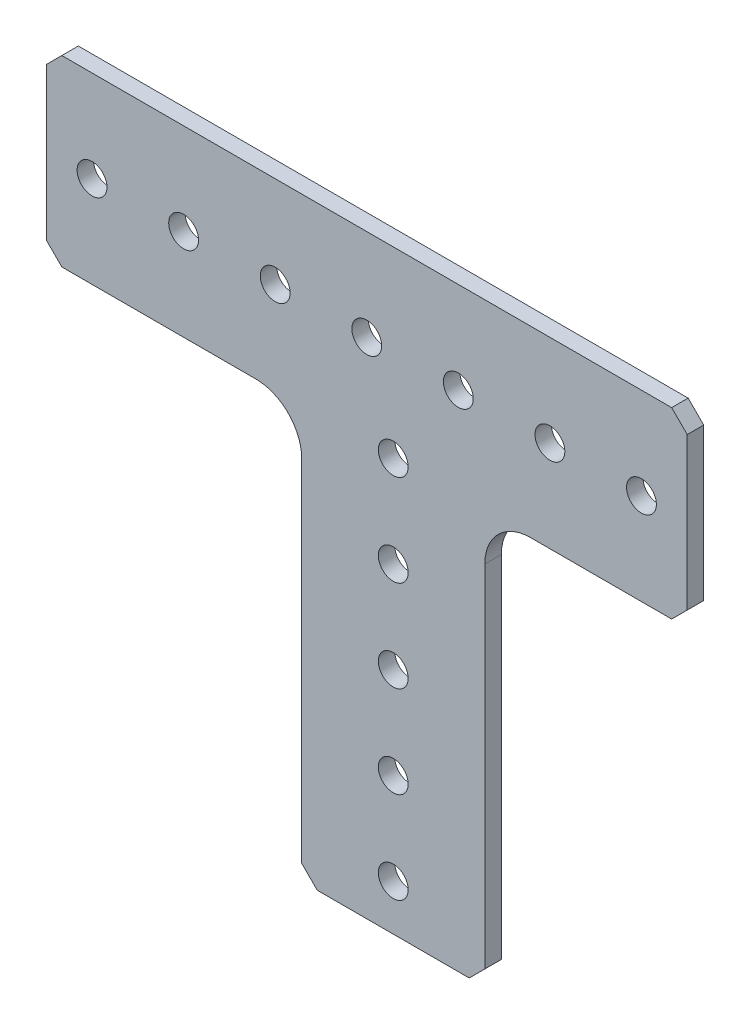
ISO-10303-21;
HEADER;
FILE_DESCRIPTION(('STEP AP214'),'2;1');
FILE_NAME('part.step','',(''),(''),'','','');
FILE_SCHEMA(('AUTOMOTIVE_DESIGN { 1 0 10303 214 1 1 1 1 }'));
ENDSEC;
DATA;
#1=APPLICATION_CONTEXT('core data for automotive mechanical design processes');
#2=APPLICATION_PROTOCOL_DEFINITION('international standard','automotive_design',2000,#1);
#3=PRODUCT_CONTEXT('',#1,'mechanical');
#4=PRODUCT('Part','Part','',(#3));
#5=PRODUCT_RELATED_PRODUCT_CATEGORY('part','',(#4));
#6=PRODUCT_DEFINITION_FORMATION('','',#4);
#7=PRODUCT_DEFINITION_CONTEXT('part definition',#1,'design');
#8=PRODUCT_DEFINITION('design','',#6,#7);
#9=PRODUCT_DEFINITION_SHAPE('','',#8);
#10=(LENGTH_UNIT() NAMED_UNIT(*) SI_UNIT(.MILLI.,.METRE.));
#11=(NAMED_UNIT(*) PLANE_ANGLE_UNIT() SI_UNIT($,.RADIAN.));
#12=(NAMED_UNIT(*) SI_UNIT($,.STERADIAN.) SOLID_ANGLE_UNIT());
#13=UNCERTAINTY_MEASURE_WITH_UNIT(LENGTH_MEASURE(1.E-05),#10,'distance_accuracy_value','');
#14=(GEOMETRIC_REPRESENTATION_CONTEXT(3) GLOBAL_UNCERTAINTY_ASSIGNED_CONTEXT((#13)) GLOBAL_UNIT_ASSIGNED_CONTEXT((#10,
#11,#12)) REPRESENTATION_CONTEXT('',''));
#15=CARTESIAN_POINT('',(0.,0.,0.));
#16=DIRECTION('',(0.,0.,1.));
#17=DIRECTION('',(1.,0.,0.));
#18=AXIS2_PLACEMENT_3D('',#15,#16,#17);
#19=CARTESIAN_POINT('',(14.213450872,-57.15,0.));
#20=DIRECTION('',(0.707106781186548,-0.707106781186547,0.));
#21=DIRECTION('',(0.707106781186547,0.707106781186548,0.));
#22=AXIS2_PLACEMENT_3D('',#19,#20,#21);
#23=PLANE('',#22);
#24=DIRECTION('',(0.707106781186547,0.707106781186548,0.));
#25=VECTOR('',#24,1.);
#26=CARTESIAN_POINT('',(14.213450872,-57.15,2.286));
#27=LINE('',#26,#25);
#28=CARTESIAN_POINT('',(14.213450872,-57.15,2.286));
#29=VERTEX_POINT('',#28);
#30=CARTESIAN_POINT('',(16.372450872,-54.991,2.286));
#31=VERTEX_POINT('',#30);
#32=EDGE_CURVE('E181',#29,#31,#27,.T.);
#33=ORIENTED_EDGE('',*,*,#32,.F.);
#34=DIRECTION('',(0.,0.,1.));
#35=VECTOR('',#34,1.);
#36=CARTESIAN_POINT('',(14.213450872,-57.15,0.));
#37=LINE('',#36,#35);
#38=CARTESIAN_POINT('',(14.213450872,-57.15,0.));
#39=VERTEX_POINT('',#38);
#40=EDGE_CURVE('E11',#39,#29,#37,.T.);
#41=ORIENTED_EDGE('',*,*,#40,.F.);
#42=DIRECTION('',(0.707106781186547,0.707106781186548,0.));
#43=VECTOR('',#42,1.);
#44=CARTESIAN_POINT('',(14.213450872,-57.15,0.));
#45=LINE('',#44,#43);
#46=CARTESIAN_POINT('',(16.372450872,-54.991,0.));
#47=VERTEX_POINT('',#46);
#48=EDGE_CURVE('E226',#39,#47,#45,.T.);
#49=ORIENTED_EDGE('',*,*,#48,.T.);
#50=DIRECTION('',(0.,0.,1.));
#51=VECTOR('',#50,1.);
#52=CARTESIAN_POINT('',(16.372450872,-54.991,0.));
#53=LINE('',#52,#51);
#54=EDGE_CURVE('E39',#47,#31,#53,.T.);
#55=ORIENTED_EDGE('',*,*,#54,.T.);
#56=EDGE_LOOP('',(#33,#41,#49,#55));
#57=FACE_BOUND('',#56,.T.);
#58=ADVANCED_FACE('F36',(#57),#23,.T.);
#59=CARTESIAN_POINT('',(-6.86854912799999,-57.15,0.));
#60=DIRECTION('',(0.,-1.,0.));
#61=DIRECTION('',(0.,0.,-1.));
#62=AXIS2_PLACEMENT_3D('',#59,#60,#61);
#63=PLANE('',#62);
#64=DIRECTION('',(1.,0.,0.));
#65=VECTOR('',#64,1.);
#66=CARTESIAN_POINT('',(-6.86854912799999,-57.15,2.286));
#67=LINE('',#66,#65);
#68=CARTESIAN_POINT('',(-6.86854912799999,-57.15,2.286));
#69=VERTEX_POINT('',#68);
#70=EDGE_CURVE('E224',#69,#29,#67,.T.);
#71=ORIENTED_EDGE('',*,*,#70,.F.);
#72=DIRECTION('',(0.,0.,1.));
#73=VECTOR('',#72,1.);
#74=CARTESIAN_POINT('',(-6.86854912799999,-57.15,0.));
#75=LINE('',#74,#73);
#76=CARTESIAN_POINT('',(-6.86854912799999,-57.15,0.));
#77=VERTEX_POINT('',#76);
#78=EDGE_CURVE('E45',#77,#69,#75,.T.);
#79=ORIENTED_EDGE('',*,*,#78,.F.);
#80=DIRECTION('',(1.,0.,0.));
#81=VECTOR('',#80,1.);
#82=CARTESIAN_POINT('',(-6.86854912799999,-57.15,0.));
#83=LINE('',#82,#81);
#84=EDGE_CURVE('E171',#77,#39,#83,.T.);
#85=ORIENTED_EDGE('',*,*,#84,.T.);
#86=ORIENTED_EDGE('',*,*,#40,.T.);
#87=EDGE_LOOP('',(#71,#79,#85,#86));
#88=FACE_BOUND('',#87,.T.);
#89=ADVANCED_FACE('F254',(#88),#63,.T.);
#90=CARTESIAN_POINT('',(-9.02754912799999,-54.991,0.));
#91=DIRECTION('',(-0.707106781186548,-0.707106781186547,0.));
#92=DIRECTION('',(0.707106781186547,-0.707106781186548,0.));
#93=AXIS2_PLACEMENT_3D('',#90,#91,#92);
#94=PLANE('',#93);
#95=DIRECTION('',(0.707106781186547,-0.707106781186548,0.));
#96=VECTOR('',#95,1.);
#97=CARTESIAN_POINT('',(-9.02754912799999,-54.991,2.286));
#98=LINE('',#97,#96);
#99=CARTESIAN_POINT('',(-9.02754912799999,-54.991,2.286));
#100=VERTEX_POINT('',#99);
#101=EDGE_CURVE('E158',#100,#69,#98,.T.);
#102=ORIENTED_EDGE('',*,*,#101,.F.);
#103=DIRECTION('',(0.,0.,1.));
#104=VECTOR('',#103,1.);
#105=CARTESIAN_POINT('',(-9.02754912799999,-54.991,0.));
#106=LINE('',#105,#104);
#107=CARTESIAN_POINT('',(-9.02754912799999,-54.991,0.));
#108=VERTEX_POINT('',#107);
#109=EDGE_CURVE('E153',#108,#100,#106,.T.);
#110=ORIENTED_EDGE('',*,*,#109,.F.);
#111=DIRECTION('',(0.707106781186547,-0.707106781186548,0.));
#112=VECTOR('',#111,1.);
#113=CARTESIAN_POINT('',(-9.02754912799999,-54.991,0.));
#114=LINE('',#113,#112);
#115=EDGE_CURVE('E156',#108,#77,#114,.T.);
#116=ORIENTED_EDGE('',*,*,#115,.T.);
#117=ORIENTED_EDGE('',*,*,#78,.T.);
#118=EDGE_LOOP('',(#102,#110,#116,#117));
#119=FACE_BOUND('',#118,.T.);
#120=ADVANCED_FACE('F155',(#119),#94,.T.);
#121=CARTESIAN_POINT('',(-9.027549128,-6.35000000000001,0.));
#122=DIRECTION('',(-1.,0.,0.));
#123=DIRECTION('',(0.,-1.,0.));
#124=AXIS2_PLACEMENT_3D('',#121,#122,#123);
#125=PLANE('',#124);
#126=DIRECTION('',(0.,-1.,0.));
#127=VECTOR('',#126,1.);
#128=CARTESIAN_POINT('',(-9.027549128,-6.35000000000001,2.286));
#129=LINE('',#128,#127);
#130=CARTESIAN_POINT('',(-9.027549128,-6.35000000000001,2.286));
#131=VERTEX_POINT('',#130);
#132=EDGE_CURVE('E221',#131,#100,#129,.T.);
#133=ORIENTED_EDGE('',*,*,#132,.F.);
#134=DIRECTION('',(0.,0.,1.));
#135=VECTOR('',#134,1.);
#136=CARTESIAN_POINT('',(-9.027549128,-6.35000000000001,0.));
#137=LINE('',#136,#135);
#138=CARTESIAN_POINT('',(-9.027549128,-6.35000000000001,0.));
#139=VERTEX_POINT('',#138);
#140=EDGE_CURVE('E163',#139,#131,#137,.T.);
#141=ORIENTED_EDGE('',*,*,#140,.F.);
#142=DIRECTION('',(0.,-1.,0.));
#143=VECTOR('',#142,1.);
#144=CARTESIAN_POINT('',(-9.027549128,-6.35000000000001,0.));
#145=LINE('',#144,#143);
#146=EDGE_CURVE('E169',#139,#108,#145,.T.);
#147=ORIENTED_EDGE('',*,*,#146,.T.);
#148=ORIENTED_EDGE('',*,*,#109,.T.);
#149=EDGE_LOOP('',(#133,#141,#147,#148));
#150=FACE_BOUND('',#149,.T.);
#151=ADVANCED_FACE('F173',(#150),#125,.T.);
#152=CARTESIAN_POINT('',(-15.377549128,-6.35000000000001,0.));
#153=DIRECTION('',(0.,0.,1.));
#154=DIRECTION('',(1.,0.,0.));
#155=AXIS2_PLACEMENT_3D('',#152,#153,#154);
#156=CYLINDRICAL_SURFACE('',#155,6.35);
#157=CARTESIAN_POINT('',(-15.377549128,-6.35000000000001,2.286));
#158=DIRECTION('',(0.,0.,-1.));
#159=DIRECTION('',(-1.,0.,0.));
#160=AXIS2_PLACEMENT_3D('',#157,#158,#159);
#161=CIRCLE('',#160,6.35);
#162=CARTESIAN_POINT('',(-15.377549128,0.,2.286));
#163=VERTEX_POINT('',#162);
#164=EDGE_CURVE('E218',#163,#131,#161,.T.);
#165=ORIENTED_EDGE('',*,*,#164,.F.);
#166=DIRECTION('',(0.,0.,1.));
#167=VECTOR('',#166,1.);
#168=CARTESIAN_POINT('',(-15.377549128,0.,0.));
#169=LINE('',#168,#167);
#170=CARTESIAN_POINT('',(-15.377549128,0.,0.));
#171=VERTEX_POINT('',#170);
#172=EDGE_CURVE('E230',#171,#163,#169,.T.);
#173=ORIENTED_EDGE('',*,*,#172,.F.);
#174=CARTESIAN_POINT('',(-15.377549128,-6.35000000000001,0.));
#175=DIRECTION('',(0.,0.,-1.));
#176=DIRECTION('',(-1.,0.,0.));
#177=AXIS2_PLACEMENT_3D('',#174,#175,#176);
#178=CIRCLE('',#177,6.35);
#179=EDGE_CURVE('E174',#171,#139,#178,.T.);
#180=ORIENTED_EDGE('',*,*,#179,.T.);
#181=ORIENTED_EDGE('',*,*,#140,.T.);
#182=EDGE_LOOP('',(#165,#173,#180,#181));
#183=FACE_BOUND('',#182,.T.);
#184=ADVANCED_FACE('F267',(#183),#156,.F.);
#185=CARTESIAN_POINT('',(-42.291,0.,0.));
#186=DIRECTION('',(0.,-1.,0.));
#187=DIRECTION('',(1.,0.,0.));
#188=AXIS2_PLACEMENT_3D('',#185,#186,#187);
#189=PLANE('',#188);
#190=DIRECTION('',(1.,0.,0.));
#191=VECTOR('',#190,1.);
#192=CARTESIAN_POINT('',(-42.291,0.,2.286));
#193=LINE('',#192,#191);
#194=CARTESIAN_POINT('',(-42.291,0.,2.286));
#195=VERTEX_POINT('',#194);
#196=EDGE_CURVE('E215',#195,#163,#193,.T.);
#197=ORIENTED_EDGE('',*,*,#196,.F.);
#198=DIRECTION('',(0.,0.,1.));
#199=VECTOR('',#198,1.);
#200=CARTESIAN_POINT('',(-42.291,0.,0.));
#201=LINE('',#200,#199);
#202=CARTESIAN_POINT('',(-42.291,0.,0.));
#203=VERTEX_POINT('',#202);
#204=EDGE_CURVE('E232',#203,#195,#201,.T.);
#205=ORIENTED_EDGE('',*,*,#204,.F.);
#206=DIRECTION('',(1.,0.,0.));
#207=VECTOR('',#206,1.);
#208=CARTESIAN_POINT('',(-42.291,0.,0.));
#209=LINE('',#208,#207);
#210=EDGE_CURVE('E176',#203,#171,#209,.T.);
#211=ORIENTED_EDGE('',*,*,#210,.T.);
#212=ORIENTED_EDGE('',*,*,#172,.T.);
#213=EDGE_LOOP('',(#197,#205,#211,#212));
#214=FACE_BOUND('',#213,.T.);
#215=ADVANCED_FACE('F270',(#214),#189,.T.);
#216=CARTESIAN_POINT('',(-44.45,2.15899999999999,0.));
#217=DIRECTION('',(-0.707106781186545,-0.70710678118655,0.));
#218=DIRECTION('',(0.70710678118655,-0.707106781186545,0.));
#219=AXIS2_PLACEMENT_3D('',#216,#217,#218);
#220=PLANE('',#219);
#221=DIRECTION('',(0.70710678118655,-0.707106781186545,0.));
#222=VECTOR('',#221,1.);
#223=CARTESIAN_POINT('',(-44.45,2.15899999999999,2.286));
#224=LINE('',#223,#222);
#225=CARTESIAN_POINT('',(-44.45,2.15899999999999,2.286));
#226=VERTEX_POINT('',#225);
#227=EDGE_CURVE('E212',#226,#195,#224,.T.);
#228=ORIENTED_EDGE('',*,*,#227,.F.);
#229=DIRECTION('',(0.,0.,1.));
#230=VECTOR('',#229,1.);
#231=CARTESIAN_POINT('',(-44.45,2.15899999999999,0.));
#232=LINE('',#231,#230);
#233=CARTESIAN_POINT('',(-44.45,2.15899999999999,0.));
#234=VERTEX_POINT('',#233);
#235=EDGE_CURVE('E234',#234,#226,#232,.T.);
#236=ORIENTED_EDGE('',*,*,#235,.F.);
#237=DIRECTION('',(0.70710678118655,-0.707106781186545,0.));
#238=VECTOR('',#237,1.);
#239=CARTESIAN_POINT('',(-44.45,2.15899999999999,0.));
#240=LINE('',#239,#238);
#241=EDGE_CURVE('E472',#234,#203,#240,.T.);
#242=ORIENTED_EDGE('',*,*,#241,.T.);
#243=ORIENTED_EDGE('',*,*,#204,.T.);
#244=EDGE_LOOP('',(#228,#236,#242,#243));
#245=FACE_BOUND('',#244,.T.);
#246=ADVANCED_FACE('F274',(#245),#220,.T.);
#247=CARTESIAN_POINT('',(-44.45,23.241,0.));
#248=DIRECTION('',(-1.,0.,0.));
#249=DIRECTION('',(0.,-1.,0.));
#250=AXIS2_PLACEMENT_3D('',#247,#248,#249);
#251=PLANE('',#250);
#252=DIRECTION('',(0.,-1.,0.));
#253=VECTOR('',#252,1.);
#254=CARTESIAN_POINT('',(-44.45,23.241,2.286));
#255=LINE('',#254,#253);
#256=CARTESIAN_POINT('',(-44.45,23.241,2.286));
#257=VERTEX_POINT('',#256);
#258=EDGE_CURVE('E209',#257,#226,#255,.T.);
#259=ORIENTED_EDGE('',*,*,#258,.F.);
#260=DIRECTION('',(0.,0.,1.));
#261=VECTOR('',#260,1.);
#262=CARTESIAN_POINT('',(-44.45,23.241,0.));
#263=LINE('',#262,#261);
#264=CARTESIAN_POINT('',(-44.45,23.241,0.));
#265=VERTEX_POINT('',#264);
#266=EDGE_CURVE('E236',#265,#257,#263,.T.);
#267=ORIENTED_EDGE('',*,*,#266,.F.);
#268=DIRECTION('',(0.,-1.,0.));
#269=VECTOR('',#268,1.);
#270=CARTESIAN_POINT('',(-44.45,23.241,0.));
#271=LINE('',#270,#269);
#272=EDGE_CURVE('E469',#265,#234,#271,.T.);
#273=ORIENTED_EDGE('',*,*,#272,.T.);
#274=ORIENTED_EDGE('',*,*,#235,.T.);
#275=EDGE_LOOP('',(#259,#267,#273,#274));
#276=FACE_BOUND('',#275,.T.);
#277=ADVANCED_FACE('F278',(#276),#251,.T.);
#278=CARTESIAN_POINT('',(-42.291,25.4,0.));
#279=DIRECTION('',(-0.707106781186543,0.707106781186552,0.));
#280=DIRECTION('',(-0.707106781186552,-0.707106781186543,0.));
#281=AXIS2_PLACEMENT_3D('',#278,#279,#280);
#282=PLANE('',#281);
#283=DIRECTION('',(-0.707106781186552,-0.707106781186543,0.));
#284=VECTOR('',#283,1.);
#285=CARTESIAN_POINT('',(-42.291,25.4,2.286));
#286=LINE('',#285,#284);
#287=CARTESIAN_POINT('',(-42.291,25.4,2.286));
#288=VERTEX_POINT('',#287);
#289=EDGE_CURVE('E206',#288,#257,#286,.T.);
#290=ORIENTED_EDGE('',*,*,#289,.F.);
#291=DIRECTION('',(0.,0.,1.));
#292=VECTOR('',#291,1.);
#293=CARTESIAN_POINT('',(-42.291,25.4,0.));
#294=LINE('',#293,#292);
#295=CARTESIAN_POINT('',(-42.291,25.4,0.));
#296=VERTEX_POINT('',#295);
#297=EDGE_CURVE('E238',#296,#288,#294,.T.);
#298=ORIENTED_EDGE('',*,*,#297,.F.);
#299=DIRECTION('',(-0.707106781186552,-0.707106781186543,0.));
#300=VECTOR('',#299,1.);
#301=CARTESIAN_POINT('',(-42.291,25.4,0.));
#302=LINE('',#301,#300);
#303=EDGE_CURVE('E466',#296,#265,#302,.T.);
#304=ORIENTED_EDGE('',*,*,#303,.T.);
#305=ORIENTED_EDGE('',*,*,#266,.T.);
#306=EDGE_LOOP('',(#290,#298,#304,#305));
#307=FACE_BOUND('',#306,.T.);
#308=ADVANCED_FACE('F282',(#307),#282,.T.);
#309=CARTESIAN_POINT('',(42.291,25.4,0.));
#310=DIRECTION('',(0.,1.,0.));
#311=DIRECTION('',(-1.,0.,0.));
#312=AXIS2_PLACEMENT_3D('',#309,#310,#311);
#313=PLANE('',#312);
#314=DIRECTION('',(-1.,0.,0.));
#315=VECTOR('',#314,1.);
#316=CARTESIAN_POINT('',(42.291,25.4,2.286));
#317=LINE('',#316,#315);
#318=CARTESIAN_POINT('',(42.291,25.4,2.286));
#319=VERTEX_POINT('',#318);
#320=EDGE_CURVE('E203',#319,#288,#317,.T.);
#321=ORIENTED_EDGE('',*,*,#320,.F.);
#322=DIRECTION('',(0.,0.,1.));
#323=VECTOR('',#322,1.);
#324=CARTESIAN_POINT('',(42.291,25.4,0.));
#325=LINE('',#324,#323);
#326=CARTESIAN_POINT('',(42.291,25.4,0.));
#327=VERTEX_POINT('',#326);
#328=EDGE_CURVE('E240',#327,#319,#325,.T.);
#329=ORIENTED_EDGE('',*,*,#328,.F.);
#330=DIRECTION('',(-1.,0.,0.));
#331=VECTOR('',#330,1.);
#332=CARTESIAN_POINT('',(42.291,25.4,0.));
#333=LINE('',#332,#331);
#334=EDGE_CURVE('E463',#327,#296,#333,.T.);
#335=ORIENTED_EDGE('',*,*,#334,.T.);
#336=ORIENTED_EDGE('',*,*,#297,.T.);
#337=EDGE_LOOP('',(#321,#329,#335,#336));
#338=FACE_BOUND('',#337,.T.);
#339=ADVANCED_FACE('F286',(#338),#313,.T.);
#340=CARTESIAN_POINT('',(44.45,23.241,0.));
#341=DIRECTION('',(0.707106781186546,0.707106781186549,0.));
#342=DIRECTION('',(-0.707106781186549,0.707106781186546,0.));
#343=AXIS2_PLACEMENT_3D('',#340,#341,#342);
#344=PLANE('',#343);
#345=DIRECTION('',(-0.707106781186549,0.707106781186546,0.));
#346=VECTOR('',#345,1.);
#347=CARTESIAN_POINT('',(44.45,23.241,2.286));
#348=LINE('',#347,#346);
#349=CARTESIAN_POINT('',(44.45,23.241,2.286));
#350=VERTEX_POINT('',#349);
#351=EDGE_CURVE('E200',#350,#319,#348,.T.);
#352=ORIENTED_EDGE('',*,*,#351,.F.);
#353=DIRECTION('',(0.,0.,1.));
#354=VECTOR('',#353,1.);
#355=CARTESIAN_POINT('',(44.45,23.241,0.));
#356=LINE('',#355,#354);
#357=CARTESIAN_POINT('',(44.45,23.241,0.));
#358=VERTEX_POINT('',#357);
#359=EDGE_CURVE('E242',#358,#350,#356,.T.);
#360=ORIENTED_EDGE('',*,*,#359,.F.);
#361=DIRECTION('',(-0.707106781186549,0.707106781186546,0.));
#362=VECTOR('',#361,1.);
#363=CARTESIAN_POINT('',(44.45,23.241,0.));
#364=LINE('',#363,#362);
#365=EDGE_CURVE('E460',#358,#327,#364,.T.);
#366=ORIENTED_EDGE('',*,*,#365,.T.);
#367=ORIENTED_EDGE('',*,*,#328,.T.);
#368=EDGE_LOOP('',(#352,#360,#366,#367));
#369=FACE_BOUND('',#368,.T.);
#370=ADVANCED_FACE('F290',(#369),#344,.T.);
#371=CARTESIAN_POINT('',(44.45,2.15900000000002,0.));
#372=DIRECTION('',(1.,0.,0.));
#373=DIRECTION('',(0.,1.,0.));
#374=AXIS2_PLACEMENT_3D('',#371,#372,#373);
#375=PLANE('',#374);
#376=DIRECTION('',(0.,1.,0.));
#377=VECTOR('',#376,1.);
#378=CARTESIAN_POINT('',(44.45,2.15900000000002,2.286));
#379=LINE('',#378,#377);
#380=CARTESIAN_POINT('',(44.45,2.15900000000002,2.286));
#381=VERTEX_POINT('',#380);
#382=EDGE_CURVE('E197',#381,#350,#379,.T.);
#383=ORIENTED_EDGE('',*,*,#382,.F.);
#384=DIRECTION('',(0.,0.,1.));
#385=VECTOR('',#384,1.);
#386=CARTESIAN_POINT('',(44.45,2.15900000000002,0.));
#387=LINE('',#386,#385);
#388=CARTESIAN_POINT('',(44.45,2.15900000000002,0.));
#389=VERTEX_POINT('',#388);
#390=EDGE_CURVE('E244',#389,#381,#387,.T.);
#391=ORIENTED_EDGE('',*,*,#390,.F.);
#392=DIRECTION('',(0.,1.,0.));
#393=VECTOR('',#392,1.);
#394=CARTESIAN_POINT('',(44.45,2.15900000000002,0.));
#395=LINE('',#394,#393);
#396=EDGE_CURVE('E457',#389,#358,#395,.T.);
#397=ORIENTED_EDGE('',*,*,#396,.T.);
#398=ORIENTED_EDGE('',*,*,#359,.T.);
#399=EDGE_LOOP('',(#383,#391,#397,#398));
#400=FACE_BOUND('',#399,.T.);
#401=ADVANCED_FACE('F294',(#400),#375,.T.);
#402=CARTESIAN_POINT('',(42.291,0.,0.));
#403=DIRECTION('',(0.707106781186549,-0.707106781186547,0.));
#404=DIRECTION('',(0.707106781186547,0.707106781186549,0.));
#405=AXIS2_PLACEMENT_3D('',#402,#403,#404);
#406=PLANE('',#405);
#407=DIRECTION('',(0.707106781186546,0.707106781186548,0.));
#408=VECTOR('',#407,1.);
#409=CARTESIAN_POINT('',(42.291,0.,2.286));
#410=LINE('',#409,#408);
#411=CARTESIAN_POINT('',(42.291,0.,2.286));
#412=VERTEX_POINT('',#411);
#413=EDGE_CURVE('E194',#412,#381,#410,.T.);
#414=ORIENTED_EDGE('',*,*,#413,.F.);
#415=DIRECTION('',(0.,0.,1.));
#416=VECTOR('',#415,1.);
#417=CARTESIAN_POINT('',(42.291,0.,0.));
#418=LINE('',#417,#416);
#419=CARTESIAN_POINT('',(42.291,0.,0.));
#420=VERTEX_POINT('',#419);
#421=EDGE_CURVE('E246',#420,#412,#418,.T.);
#422=ORIENTED_EDGE('',*,*,#421,.F.);
#423=DIRECTION('',(0.707106781186546,0.707106781186548,0.));
#424=VECTOR('',#423,1.);
#425=CARTESIAN_POINT('',(42.291,0.,0.));
#426=LINE('',#425,#424);
#427=EDGE_CURVE('E454',#420,#389,#426,.T.);
#428=ORIENTED_EDGE('',*,*,#427,.T.);
#429=ORIENTED_EDGE('',*,*,#390,.T.);
#430=EDGE_LOOP('',(#414,#422,#428,#429));
#431=FACE_BOUND('',#430,.T.);
#432=ADVANCED_FACE('F298',(#431),#406,.T.);
#433=CARTESIAN_POINT('',(22.722450872,0.,0.));
#434=DIRECTION('',(0.,-1.,0.));
#435=DIRECTION('',(1.,0.,0.));
#436=AXIS2_PLACEMENT_3D('',#433,#434,#435);
#437=PLANE('',#436);
#438=DIRECTION('',(1.,0.,0.));
#439=VECTOR('',#438,1.);
#440=CARTESIAN_POINT('',(22.722450872,0.,2.286));
#441=LINE('',#440,#439);
#442=CARTESIAN_POINT('',(22.722450872,0.,2.286));
#443=VERTEX_POINT('',#442);
#444=EDGE_CURVE('E191',#443,#412,#441,.T.);
#445=ORIENTED_EDGE('',*,*,#444,.F.);
#446=DIRECTION('',(0.,0.,1.));
#447=VECTOR('',#446,1.);
#448=CARTESIAN_POINT('',(22.722450872,0.,0.));
#449=LINE('',#448,#447);
#450=CARTESIAN_POINT('',(22.722450872,0.,0.));
#451=VERTEX_POINT('',#450);
#452=EDGE_CURVE('E248',#451,#443,#449,.T.);
#453=ORIENTED_EDGE('',*,*,#452,.F.);
#454=DIRECTION('',(1.,0.,0.));
#455=VECTOR('',#454,1.);
#456=CARTESIAN_POINT('',(22.722450872,0.,0.));
#457=LINE('',#456,#455);
#458=EDGE_CURVE('E451',#451,#420,#457,.T.);
#459=ORIENTED_EDGE('',*,*,#458,.T.);
#460=ORIENTED_EDGE('',*,*,#421,.T.);
#461=EDGE_LOOP('',(#445,#453,#459,#460));
#462=FACE_BOUND('',#461,.T.);
#463=ADVANCED_FACE('F302',(#462),#437,.T.);
#464=CARTESIAN_POINT('',(22.722450872,-6.35000000000002,0.));
#465=DIRECTION('',(0.,0.,1.));
#466=DIRECTION('',(1.,0.,0.));
#467=AXIS2_PLACEMENT_3D('',#464,#465,#466);
#468=CYLINDRICAL_SURFACE('',#467,6.35000000000001);
#469=CARTESIAN_POINT('',(22.722450872,-6.35000000000002,2.286));
#470=DIRECTION('',(0.,0.,-1.));
#471=DIRECTION('',(-1.,0.,0.));
#472=AXIS2_PLACEMENT_3D('',#469,#470,#471);
#473=CIRCLE('',#472,6.35000000000001);
#474=CARTESIAN_POINT('',(16.372450872,-6.35000000000002,2.286));
#475=VERTEX_POINT('',#474);
#476=EDGE_CURVE('E188',#475,#443,#473,.T.);
#477=ORIENTED_EDGE('',*,*,#476,.F.);
#478=DIRECTION('',(0.,0.,1.));
#479=VECTOR('',#478,1.);
#480=CARTESIAN_POINT('',(16.372450872,-6.35000000000002,0.));
#481=LINE('',#480,#479);
#482=CARTESIAN_POINT('',(16.372450872,-6.35000000000002,0.));
#483=VERTEX_POINT('',#482);
#484=EDGE_CURVE('E249',#483,#475,#481,.T.);
#485=ORIENTED_EDGE('',*,*,#484,.F.);
#486=CARTESIAN_POINT('',(22.722450872,-6.35000000000002,0.));
#487=DIRECTION('',(0.,0.,-1.));
#488=DIRECTION('',(-1.,0.,0.));
#489=AXIS2_PLACEMENT_3D('',#486,#487,#488);
#490=CIRCLE('',#489,6.35000000000001);
#491=EDGE_CURVE('E448',#483,#451,#490,.T.);
#492=ORIENTED_EDGE('',*,*,#491,.T.);
#493=ORIENTED_EDGE('',*,*,#452,.T.);
#494=EDGE_LOOP('',(#477,#485,#492,#493));
#495=FACE_BOUND('',#494,.T.);
#496=ADVANCED_FACE('F306',(#495),#468,.F.);
#497=CARTESIAN_POINT('',(16.372450872,-54.991,0.));
#498=DIRECTION('',(1.,0.,0.));
#499=DIRECTION('',(0.,0.,-1.));
#500=AXIS2_PLACEMENT_3D('',#497,#498,#499);
#501=PLANE('',#500);
#502=DIRECTION('',(0.,1.,0.));
#503=VECTOR('',#502,1.);
#504=CARTESIAN_POINT('',(16.372450872,-54.991,2.286));
#505=LINE('',#504,#503);
#506=EDGE_CURVE('E184',#31,#475,#505,.T.);
#507=ORIENTED_EDGE('',*,*,#506,.F.);
#508=ORIENTED_EDGE('',*,*,#54,.F.);
#509=DIRECTION('',(0.,1.,0.));
#510=VECTOR('',#509,1.);
#511=CARTESIAN_POINT('',(16.372450872,-54.991,0.));
#512=LINE('',#511,#510);
#513=EDGE_CURVE('E446',#47,#483,#512,.T.);
#514=ORIENTED_EDGE('',*,*,#513,.T.);
#515=ORIENTED_EDGE('',*,*,#484,.T.);
#516=EDGE_LOOP('',(#507,#508,#514,#515));
#517=FACE_BOUND('',#516,.T.);
#518=ADVANCED_FACE('F251',(#517),#501,.T.);
#519=CARTESIAN_POINT('',(22.722450872,-6.35000000000002,0.));
#520=DIRECTION('',(0.,0.,-1.));
#521=DIRECTION('',(-1.,0.,0.));
#522=AXIS2_PLACEMENT_3D('',#519,#520,#521);
#523=PLANE('',#522);
#524=CARTESIAN_POINT('',(3.67245087200001,-50.8,0.));
#525=DIRECTION('',(0.,0.,1.));
#526=DIRECTION('',(-1.,0.,0.));
#527=AXIS2_PLACEMENT_3D('',#524,#525,#526);
#528=CIRCLE('',#527,2.07010000000001);
#529=CARTESIAN_POINT('',(1.602350872,-50.8,0.));
#530=VERTEX_POINT('',#529);
#531=EDGE_CURVE('E373',#530,#530,#528,.T.);
#532=ORIENTED_EDGE('',*,*,#531,.T.);
#533=EDGE_LOOP('',(#532));
#534=FACE_BOUND('',#533,.T.);
#535=CARTESIAN_POINT('',(3.672450872,-25.4,0.));
#536=DIRECTION('',(0.,0.,1.));
#537=DIRECTION('',(-1.,0.,0.));
#538=AXIS2_PLACEMENT_3D('',#535,#536,#537);
#539=CIRCLE('',#538,2.0701);
#540=CARTESIAN_POINT('',(1.602350872,-25.4,0.));
#541=VERTEX_POINT('',#540);
#542=EDGE_CURVE('E381',#541,#541,#539,.T.);
#543=ORIENTED_EDGE('',*,*,#542,.T.);
#544=EDGE_LOOP('',(#543));
#545=FACE_BOUND('',#544,.T.);
#546=CARTESIAN_POINT('',(3.672450872,0.,0.));
#547=DIRECTION('',(0.,0.,1.));
#548=DIRECTION('',(-1.,0.,0.));
#549=AXIS2_PLACEMENT_3D('',#546,#547,#548);
#550=CIRCLE('',#549,2.0701);
#551=CARTESIAN_POINT('',(1.602350872,0.,0.));
#552=VERTEX_POINT('',#551);
#553=EDGE_CURVE('E387',#552,#552,#550,.T.);
#554=ORIENTED_EDGE('',*,*,#553,.T.);
#555=EDGE_LOOP('',(#554));
#556=FACE_BOUND('',#555,.T.);
#557=CARTESIAN_POINT('',(25.4,12.7,0.));
#558=DIRECTION('',(0.,0.,1.));
#559=DIRECTION('',(-1.,0.,0.));
#560=AXIS2_PLACEMENT_3D('',#557,#558,#559);
#561=CIRCLE('',#560,2.0701);
#562=CARTESIAN_POINT('',(23.3299,12.7,0.));
#563=VERTEX_POINT('',#562);
#564=EDGE_CURVE('E393',#563,#563,#561,.T.);
#565=ORIENTED_EDGE('',*,*,#564,.T.);
#566=EDGE_LOOP('',(#565));
#567=FACE_BOUND('',#566,.T.);
#568=CARTESIAN_POINT('',(0.,12.7,0.));
#569=DIRECTION('',(0.,0.,1.));
#570=DIRECTION('',(-1.,0.,0.));
#571=AXIS2_PLACEMENT_3D('',#568,#569,#570);
#572=CIRCLE('',#571,2.0701);
#573=CARTESIAN_POINT('',(-2.0701,12.7,0.));
#574=VERTEX_POINT('',#573);
#575=EDGE_CURVE('E399',#574,#574,#572,.T.);
#576=ORIENTED_EDGE('',*,*,#575,.T.);
#577=EDGE_LOOP('',(#576));
#578=FACE_BOUND('',#577,.T.);
#579=CARTESIAN_POINT('',(-25.4,12.7,0.));
#580=DIRECTION('',(0.,0.,1.));
#581=DIRECTION('',(-1.,0.,0.));
#582=AXIS2_PLACEMENT_3D('',#579,#580,#581);
#583=CIRCLE('',#582,2.0701);
#584=CARTESIAN_POINT('',(-27.4701,12.7,0.));
#585=VERTEX_POINT('',#584);
#586=EDGE_CURVE('E405',#585,#585,#583,.T.);
#587=ORIENTED_EDGE('',*,*,#586,.T.);
#588=EDGE_LOOP('',(#587));
#589=FACE_BOUND('',#588,.T.);
#590=CARTESIAN_POINT('',(-38.1,12.7,0.));
#591=DIRECTION('',(0.,0.,1.));
#592=DIRECTION('',(-1.,0.,0.));
#593=AXIS2_PLACEMENT_3D('',#590,#591,#592);
#594=CIRCLE('',#593,2.0701);
#595=CARTESIAN_POINT('',(-40.1701,12.7,0.));
#596=VERTEX_POINT('',#595);
#597=EDGE_CURVE('E411',#596,#596,#594,.T.);
#598=ORIENTED_EDGE('',*,*,#597,.T.);
#599=EDGE_LOOP('',(#598));
#600=FACE_BOUND('',#599,.T.);
#601=CARTESIAN_POINT('',(-12.7,12.7,0.));
#602=DIRECTION('',(0.,0.,1.));
#603=DIRECTION('',(-1.,0.,0.));
#604=AXIS2_PLACEMENT_3D('',#601,#602,#603);
#605=CIRCLE('',#604,2.0701);
#606=CARTESIAN_POINT('',(-14.7701,12.7,0.));
#607=VERTEX_POINT('',#606);
#608=EDGE_CURVE('E417',#607,#607,#605,.T.);
#609=ORIENTED_EDGE('',*,*,#608,.T.);
#610=EDGE_LOOP('',(#609));
#611=FACE_BOUND('',#610,.T.);
#612=CARTESIAN_POINT('',(12.7,12.7,0.));
#613=DIRECTION('',(0.,0.,1.));
#614=DIRECTION('',(-1.,0.,0.));
#615=AXIS2_PLACEMENT_3D('',#612,#613,#614);
#616=CIRCLE('',#615,2.0701);
#617=CARTESIAN_POINT('',(10.6299,12.7,0.));
#618=VERTEX_POINT('',#617);
#619=EDGE_CURVE('E423',#618,#618,#616,.T.);
#620=ORIENTED_EDGE('',*,*,#619,.T.);
#621=EDGE_LOOP('',(#620));
#622=FACE_BOUND('',#621,.T.);
#623=CARTESIAN_POINT('',(38.1,12.7,0.));
#624=DIRECTION('',(0.,0.,1.));
#625=DIRECTION('',(-1.,0.,0.));
#626=AXIS2_PLACEMENT_3D('',#623,#624,#625);
#627=CIRCLE('',#626,2.0701);
#628=CARTESIAN_POINT('',(36.0299,12.7,0.));
#629=VERTEX_POINT('',#628);
#630=EDGE_CURVE('E429',#629,#629,#627,.T.);
#631=ORIENTED_EDGE('',*,*,#630,.T.);
#632=EDGE_LOOP('',(#631));
#633=FACE_BOUND('',#632,.T.);
#634=CARTESIAN_POINT('',(3.672450872,-12.7,0.));
#635=DIRECTION('',(0.,0.,1.));
#636=DIRECTION('',(-1.,0.,0.));
#637=AXIS2_PLACEMENT_3D('',#634,#635,#636);
#638=CIRCLE('',#637,2.0701);
#639=CARTESIAN_POINT('',(1.602350872,-12.7,0.));
#640=VERTEX_POINT('',#639);
#641=EDGE_CURVE('E435',#640,#640,#638,.T.);
#642=ORIENTED_EDGE('',*,*,#641,.T.);
#643=EDGE_LOOP('',(#642));
#644=FACE_BOUND('',#643,.T.);
#645=CARTESIAN_POINT('',(3.672450872,-38.1,0.));
#646=DIRECTION('',(0.,0.,1.));
#647=DIRECTION('',(-1.,0.,0.));
#648=AXIS2_PLACEMENT_3D('',#645,#646,#647);
#649=CIRCLE('',#648,2.07010000000001);
#650=CARTESIAN_POINT('',(1.602350872,-38.1,0.));
#651=VERTEX_POINT('',#650);
#652=EDGE_CURVE('E185',#651,#651,#649,.T.);
#653=ORIENTED_EDGE('',*,*,#652,.T.);
#654=EDGE_LOOP('',(#653));
#655=FACE_BOUND('',#654,.T.);
#656=ORIENTED_EDGE('',*,*,#48,.F.);
#657=ORIENTED_EDGE('',*,*,#84,.F.);
#658=ORIENTED_EDGE('',*,*,#115,.F.);
#659=ORIENTED_EDGE('',*,*,#146,.F.);
#660=ORIENTED_EDGE('',*,*,#179,.F.);
#661=ORIENTED_EDGE('',*,*,#210,.F.);
#662=ORIENTED_EDGE('',*,*,#241,.F.);
#663=ORIENTED_EDGE('',*,*,#272,.F.);
#664=ORIENTED_EDGE('',*,*,#303,.F.);
#665=ORIENTED_EDGE('',*,*,#334,.F.);
#666=ORIENTED_EDGE('',*,*,#365,.F.);
#667=ORIENTED_EDGE('',*,*,#396,.F.);
#668=ORIENTED_EDGE('',*,*,#427,.F.);
#669=ORIENTED_EDGE('',*,*,#458,.F.);
#670=ORIENTED_EDGE('',*,*,#491,.F.);
#671=ORIENTED_EDGE('',*,*,#513,.F.);
#672=EDGE_LOOP('',(#656,#657,#658,#659,#660,#661,#662,#663,#664,#665,#666,#667,#668,#669,#670,#671));
#673=FACE_BOUND('',#672,.T.);
#674=ADVANCED_FACE('F167',(#534,#545,#556,#567,#578,#589,#600,#611,#622,#633,#644,#655,#673),
#523,.T.);
#675=CARTESIAN_POINT('',(22.722450872,-6.35000000000002,2.286));
#676=DIRECTION('',(0.,0.,-1.));
#677=DIRECTION('',(-1.,0.,0.));
#678=AXIS2_PLACEMENT_3D('',#675,#676,#677);
#679=PLANE('',#678);
#680=CARTESIAN_POINT('',(3.67245087200001,-50.8,2.286));
#681=DIRECTION('',(0.,0.,1.));
#682=DIRECTION('',(-1.,0.,0.));
#683=AXIS2_PLACEMENT_3D('',#680,#681,#682);
#684=CIRCLE('',#683,2.07010000000001);
#685=CARTESIAN_POINT('',(1.602350872,-50.8,2.286));
#686=VERTEX_POINT('',#685);
#687=EDGE_CURVE('E376',#686,#686,#684,.T.);
#688=ORIENTED_EDGE('',*,*,#687,.F.);
#689=EDGE_LOOP('',(#688));
#690=FACE_BOUND('',#689,.T.);
#691=CARTESIAN_POINT('',(3.672450872,-25.4,2.286));
#692=DIRECTION('',(0.,0.,1.));
#693=DIRECTION('',(-1.,0.,0.));
#694=AXIS2_PLACEMENT_3D('',#691,#692,#693);
#695=CIRCLE('',#694,2.0701);
#696=CARTESIAN_POINT('',(1.602350872,-25.4,2.286));
#697=VERTEX_POINT('',#696);
#698=EDGE_CURVE('E378',#697,#697,#695,.T.);
#699=ORIENTED_EDGE('',*,*,#698,.F.);
#700=EDGE_LOOP('',(#699));
#701=FACE_BOUND('',#700,.T.);
#702=CARTESIAN_POINT('',(3.672450872,0.,2.286));
#703=DIRECTION('',(0.,0.,1.));
#704=DIRECTION('',(-1.,0.,0.));
#705=AXIS2_PLACEMENT_3D('',#702,#703,#704);
#706=CIRCLE('',#705,2.0701);
#707=CARTESIAN_POINT('',(1.602350872,0.,2.286));
#708=VERTEX_POINT('',#707);
#709=EDGE_CURVE('E384',#708,#708,#706,.T.);
#710=ORIENTED_EDGE('',*,*,#709,.F.);
#711=EDGE_LOOP('',(#710));
#712=FACE_BOUND('',#711,.T.);
#713=CARTESIAN_POINT('',(25.4,12.7,2.286));
#714=DIRECTION('',(0.,0.,1.));
#715=DIRECTION('',(-1.,0.,0.));
#716=AXIS2_PLACEMENT_3D('',#713,#714,#715);
#717=CIRCLE('',#716,2.0701);
#718=CARTESIAN_POINT('',(23.3299,12.7,2.286));
#719=VERTEX_POINT('',#718);
#720=EDGE_CURVE('E390',#719,#719,#717,.T.);
#721=ORIENTED_EDGE('',*,*,#720,.F.);
#722=EDGE_LOOP('',(#721));
#723=FACE_BOUND('',#722,.T.);
#724=CARTESIAN_POINT('',(0.,12.7,2.286));
#725=DIRECTION('',(0.,0.,1.));
#726=DIRECTION('',(-1.,0.,0.));
#727=AXIS2_PLACEMENT_3D('',#724,#725,#726);
#728=CIRCLE('',#727,2.0701);
#729=CARTESIAN_POINT('',(-2.0701,12.7,2.286));
#730=VERTEX_POINT('',#729);
#731=EDGE_CURVE('E396',#730,#730,#728,.T.);
#732=ORIENTED_EDGE('',*,*,#731,.F.);
#733=EDGE_LOOP('',(#732));
#734=FACE_BOUND('',#733,.T.);
#735=CARTESIAN_POINT('',(-25.4,12.7,2.286));
#736=DIRECTION('',(0.,0.,1.));
#737=DIRECTION('',(-1.,0.,0.));
#738=AXIS2_PLACEMENT_3D('',#735,#736,#737);
#739=CIRCLE('',#738,2.0701);
#740=CARTESIAN_POINT('',(-27.4701,12.7,2.286));
#741=VERTEX_POINT('',#740);
#742=EDGE_CURVE('E402',#741,#741,#739,.T.);
#743=ORIENTED_EDGE('',*,*,#742,.F.);
#744=EDGE_LOOP('',(#743));
#745=FACE_BOUND('',#744,.T.);
#746=CARTESIAN_POINT('',(-38.1,12.7,2.286));
#747=DIRECTION('',(0.,0.,1.));
#748=DIRECTION('',(-1.,0.,0.));
#749=AXIS2_PLACEMENT_3D('',#746,#747,#748);
#750=CIRCLE('',#749,2.0701);
#751=CARTESIAN_POINT('',(-40.1701,12.7,2.286));
#752=VERTEX_POINT('',#751);
#753=EDGE_CURVE('E408',#752,#752,#750,.T.);
#754=ORIENTED_EDGE('',*,*,#753,.F.);
#755=EDGE_LOOP('',(#754));
#756=FACE_BOUND('',#755,.T.);
#757=CARTESIAN_POINT('',(-12.7,12.7,2.286));
#758=DIRECTION('',(0.,0.,1.));
#759=DIRECTION('',(-1.,0.,0.));
#760=AXIS2_PLACEMENT_3D('',#757,#758,#759);
#761=CIRCLE('',#760,2.0701);
#762=CARTESIAN_POINT('',(-14.7701,12.7,2.286));
#763=VERTEX_POINT('',#762);
#764=EDGE_CURVE('E414',#763,#763,#761,.T.);
#765=ORIENTED_EDGE('',*,*,#764,.F.);
#766=EDGE_LOOP('',(#765));
#767=FACE_BOUND('',#766,.T.);
#768=CARTESIAN_POINT('',(12.7,12.7,2.286));
#769=DIRECTION('',(0.,0.,1.));
#770=DIRECTION('',(-1.,0.,0.));
#771=AXIS2_PLACEMENT_3D('',#768,#769,#770);
#772=CIRCLE('',#771,2.0701);
#773=CARTESIAN_POINT('',(10.6299,12.7,2.286));
#774=VERTEX_POINT('',#773);
#775=EDGE_CURVE('E420',#774,#774,#772,.T.);
#776=ORIENTED_EDGE('',*,*,#775,.F.);
#777=EDGE_LOOP('',(#776));
#778=FACE_BOUND('',#777,.T.);
#779=CARTESIAN_POINT('',(38.1,12.7,2.286));
#780=DIRECTION('',(0.,0.,1.));
#781=DIRECTION('',(-1.,0.,0.));
#782=AXIS2_PLACEMENT_3D('',#779,#780,#781);
#783=CIRCLE('',#782,2.0701);
#784=CARTESIAN_POINT('',(36.0299,12.7,2.286));
#785=VERTEX_POINT('',#784);
#786=EDGE_CURVE('E426',#785,#785,#783,.T.);
#787=ORIENTED_EDGE('',*,*,#786,.F.);
#788=EDGE_LOOP('',(#787));
#789=FACE_BOUND('',#788,.T.);
#790=CARTESIAN_POINT('',(3.672450872,-12.7,2.286));
#791=DIRECTION('',(0.,0.,1.));
#792=DIRECTION('',(-1.,0.,0.));
#793=AXIS2_PLACEMENT_3D('',#790,#791,#792);
#794=CIRCLE('',#793,2.0701);
#795=CARTESIAN_POINT('',(1.602350872,-12.7,2.286));
#796=VERTEX_POINT('',#795);
#797=EDGE_CURVE('E432',#796,#796,#794,.T.);
#798=ORIENTED_EDGE('',*,*,#797,.F.);
#799=EDGE_LOOP('',(#798));
#800=FACE_BOUND('',#799,.T.);
#801=CARTESIAN_POINT('',(3.672450872,-38.1,2.286));
#802=DIRECTION('',(0.,0.,1.));
#803=DIRECTION('',(-1.,0.,0.));
#804=AXIS2_PLACEMENT_3D('',#801,#802,#803);
#805=CIRCLE('',#804,2.07010000000001);
#806=CARTESIAN_POINT('',(1.602350872,-38.1,2.286));
#807=VERTEX_POINT('',#806);
#808=EDGE_CURVE('E438',#807,#807,#805,.T.);
#809=ORIENTED_EDGE('',*,*,#808,.F.);
#810=EDGE_LOOP('',(#809));
#811=FACE_BOUND('',#810,.T.);
#812=ORIENTED_EDGE('',*,*,#32,.T.);
#813=ORIENTED_EDGE('',*,*,#506,.T.);
#814=ORIENTED_EDGE('',*,*,#476,.T.);
#815=ORIENTED_EDGE('',*,*,#444,.T.);
#816=ORIENTED_EDGE('',*,*,#413,.T.);
#817=ORIENTED_EDGE('',*,*,#382,.T.);
#818=ORIENTED_EDGE('',*,*,#351,.T.);
#819=ORIENTED_EDGE('',*,*,#320,.T.);
#820=ORIENTED_EDGE('',*,*,#289,.T.);
#821=ORIENTED_EDGE('',*,*,#258,.T.);
#822=ORIENTED_EDGE('',*,*,#227,.T.);
#823=ORIENTED_EDGE('',*,*,#196,.T.);
#824=ORIENTED_EDGE('',*,*,#164,.T.);
#825=ORIENTED_EDGE('',*,*,#132,.T.);
#826=ORIENTED_EDGE('',*,*,#101,.T.);
#827=ORIENTED_EDGE('',*,*,#70,.T.);
#828=EDGE_LOOP('',(#812,#813,#814,#815,#816,#817,#818,#819,#820,#821,#822,#823,#824,#825,#826,#827));
#829=FACE_BOUND('',#828,.T.);
#830=ADVANCED_FACE('F253',(#690,#701,#712,#723,#734,#745,#756,#767,#778,#789,#800,#811,#829),
#679,.F.);
#831=CARTESIAN_POINT('',(3.672450872,-38.1,0.));
#832=DIRECTION('',(0.,0.,1.));
#833=DIRECTION('',(1.,0.,0.));
#834=AXIS2_PLACEMENT_3D('',#831,#832,#833);
#835=CYLINDRICAL_SURFACE('',#834,2.07010000000001);
#836=ORIENTED_EDGE('',*,*,#652,.F.);
#837=EDGE_LOOP('',(#836));
#838=FACE_BOUND('',#837,.T.);
#839=ORIENTED_EDGE('',*,*,#808,.T.);
#840=EDGE_LOOP('',(#839));
#841=FACE_BOUND('',#840,.T.);
#842=ADVANCED_FACE('F318',(#838,#841),#835,.F.);
#843=CARTESIAN_POINT('',(3.672450872,-12.7,0.));
#844=DIRECTION('',(0.,0.,1.));
#845=DIRECTION('',(1.,0.,0.));
#846=AXIS2_PLACEMENT_3D('',#843,#844,#845);
#847=CYLINDRICAL_SURFACE('',#846,2.0701);
#848=ORIENTED_EDGE('',*,*,#641,.F.);
#849=EDGE_LOOP('',(#848));
#850=FACE_BOUND('',#849,.T.);
#851=ORIENTED_EDGE('',*,*,#797,.T.);
#852=EDGE_LOOP('',(#851));
#853=FACE_BOUND('',#852,.T.);
#854=ADVANCED_FACE('F325',(#850,#853),#847,.F.);
#855=CARTESIAN_POINT('',(38.1,12.7,0.));
#856=DIRECTION('',(0.,0.,1.));
#857=DIRECTION('',(1.,0.,0.));
#858=AXIS2_PLACEMENT_3D('',#855,#856,#857);
#859=CYLINDRICAL_SURFACE('',#858,2.0701);
#860=ORIENTED_EDGE('',*,*,#630,.F.);
#861=EDGE_LOOP('',(#860));
#862=FACE_BOUND('',#861,.T.);
#863=ORIENTED_EDGE('',*,*,#786,.T.);
#864=EDGE_LOOP('',(#863));
#865=FACE_BOUND('',#864,.T.);
#866=ADVANCED_FACE('F329',(#862,#865),#859,.F.);
#867=CARTESIAN_POINT('',(12.7,12.7,0.));
#868=DIRECTION('',(0.,0.,1.));
#869=DIRECTION('',(1.,0.,0.));
#870=AXIS2_PLACEMENT_3D('',#867,#868,#869);
#871=CYLINDRICAL_SURFACE('',#870,2.0701);
#872=ORIENTED_EDGE('',*,*,#619,.F.);
#873=EDGE_LOOP('',(#872));
#874=FACE_BOUND('',#873,.T.);
#875=ORIENTED_EDGE('',*,*,#775,.T.);
#876=EDGE_LOOP('',(#875));
#877=FACE_BOUND('',#876,.T.);
#878=ADVANCED_FACE('F333',(#874,#877),#871,.F.);
#879=CARTESIAN_POINT('',(-12.7,12.7,0.));
#880=DIRECTION('',(0.,0.,1.));
#881=DIRECTION('',(1.,0.,0.));
#882=AXIS2_PLACEMENT_3D('',#879,#880,#881);
#883=CYLINDRICAL_SURFACE('',#882,2.0701);
#884=ORIENTED_EDGE('',*,*,#608,.F.);
#885=EDGE_LOOP('',(#884));
#886=FACE_BOUND('',#885,.T.);
#887=ORIENTED_EDGE('',*,*,#764,.T.);
#888=EDGE_LOOP('',(#887));
#889=FACE_BOUND('',#888,.T.);
#890=ADVANCED_FACE('F337',(#886,#889),#883,.F.);
#891=CARTESIAN_POINT('',(-38.1,12.7,0.));
#892=DIRECTION('',(0.,0.,1.));
#893=DIRECTION('',(1.,0.,0.));
#894=AXIS2_PLACEMENT_3D('',#891,#892,#893);
#895=CYLINDRICAL_SURFACE('',#894,2.0701);
#896=ORIENTED_EDGE('',*,*,#597,.F.);
#897=EDGE_LOOP('',(#896));
#898=FACE_BOUND('',#897,.T.);
#899=ORIENTED_EDGE('',*,*,#753,.T.);
#900=EDGE_LOOP('',(#899));
#901=FACE_BOUND('',#900,.T.);
#902=ADVANCED_FACE('F341',(#898,#901),#895,.F.);
#903=CARTESIAN_POINT('',(-25.4,12.7,0.));
#904=DIRECTION('',(0.,0.,1.));
#905=DIRECTION('',(1.,0.,0.));
#906=AXIS2_PLACEMENT_3D('',#903,#904,#905);
#907=CYLINDRICAL_SURFACE('',#906,2.0701);
#908=ORIENTED_EDGE('',*,*,#586,.F.);
#909=EDGE_LOOP('',(#908));
#910=FACE_BOUND('',#909,.T.);
#911=ORIENTED_EDGE('',*,*,#742,.T.);
#912=EDGE_LOOP('',(#911));
#913=FACE_BOUND('',#912,.T.);
#914=ADVANCED_FACE('F345',(#910,#913),#907,.F.);
#915=CARTESIAN_POINT('',(0.,12.7,0.));
#916=DIRECTION('',(0.,0.,1.));
#917=DIRECTION('',(1.,0.,0.));
#918=AXIS2_PLACEMENT_3D('',#915,#916,#917);
#919=CYLINDRICAL_SURFACE('',#918,2.0701);
#920=ORIENTED_EDGE('',*,*,#575,.F.);
#921=EDGE_LOOP('',(#920));
#922=FACE_BOUND('',#921,.T.);
#923=ORIENTED_EDGE('',*,*,#731,.T.);
#924=EDGE_LOOP('',(#923));
#925=FACE_BOUND('',#924,.T.);
#926=ADVANCED_FACE('F349',(#922,#925),#919,.F.);
#927=CARTESIAN_POINT('',(25.4,12.7,0.));
#928=DIRECTION('',(0.,0.,1.));
#929=DIRECTION('',(1.,0.,0.));
#930=AXIS2_PLACEMENT_3D('',#927,#928,#929);
#931=CYLINDRICAL_SURFACE('',#930,2.0701);
#932=ORIENTED_EDGE('',*,*,#564,.F.);
#933=EDGE_LOOP('',(#932));
#934=FACE_BOUND('',#933,.T.);
#935=ORIENTED_EDGE('',*,*,#720,.T.);
#936=EDGE_LOOP('',(#935));
#937=FACE_BOUND('',#936,.T.);
#938=ADVANCED_FACE('F353',(#934,#937),#931,.F.);
#939=CARTESIAN_POINT('',(3.672450872,0.,0.));
#940=DIRECTION('',(0.,0.,1.));
#941=DIRECTION('',(1.,0.,0.));
#942=AXIS2_PLACEMENT_3D('',#939,#940,#941);
#943=CYLINDRICAL_SURFACE('',#942,2.0701);
#944=ORIENTED_EDGE('',*,*,#553,.F.);
#945=EDGE_LOOP('',(#944));
#946=FACE_BOUND('',#945,.T.);
#947=ORIENTED_EDGE('',*,*,#709,.T.);
#948=EDGE_LOOP('',(#947));
#949=FACE_BOUND('',#948,.T.);
#950=ADVANCED_FACE('F357',(#946,#949),#943,.F.);
#951=CARTESIAN_POINT('',(3.672450872,-25.4,0.));
#952=DIRECTION('',(0.,0.,1.));
#953=DIRECTION('',(1.,0.,0.));
#954=AXIS2_PLACEMENT_3D('',#951,#952,#953);
#955=CYLINDRICAL_SURFACE('',#954,2.0701);
#956=ORIENTED_EDGE('',*,*,#542,.F.);
#957=EDGE_LOOP('',(#956));
#958=FACE_BOUND('',#957,.T.);
#959=ORIENTED_EDGE('',*,*,#698,.T.);
#960=EDGE_LOOP('',(#959));
#961=FACE_BOUND('',#960,.T.);
#962=ADVANCED_FACE('F361',(#958,#961),#955,.F.);
#963=CARTESIAN_POINT('',(3.67245087200001,-50.8,0.));
#964=DIRECTION('',(0.,0.,1.));
#965=DIRECTION('',(1.,0.,0.));
#966=AXIS2_PLACEMENT_3D('',#963,#964,#965);
#967=CYLINDRICAL_SURFACE('',#966,2.07010000000001);
#968=ORIENTED_EDGE('',*,*,#531,.F.);
#969=EDGE_LOOP('',(#968));
#970=FACE_BOUND('',#969,.T.);
#971=ORIENTED_EDGE('',*,*,#687,.T.);
#972=EDGE_LOOP('',(#971));
#973=FACE_BOUND('',#972,.T.);
#974=ADVANCED_FACE('F365',(#970,#973),#967,.F.);
#975=CLOSED_SHELL('',(#58,#89,#120,#151,#184,#215,#246,#277,#308,#339,#370,#401,#432,#463,#496,
#518,#674,#830,#842,#854,#866,#878,#890,#902,#914,#926,#938,#950,#962,#974));
#976=MANIFOLD_SOLID_BREP('B2',#975);
#977=ADVANCED_BREP_SHAPE_REPRESENTATION('',(#18,#976),#14);
#978=SHAPE_DEFINITION_REPRESENTATION(#9,#977);
ENDSEC;
END-ISO-10303-21;
